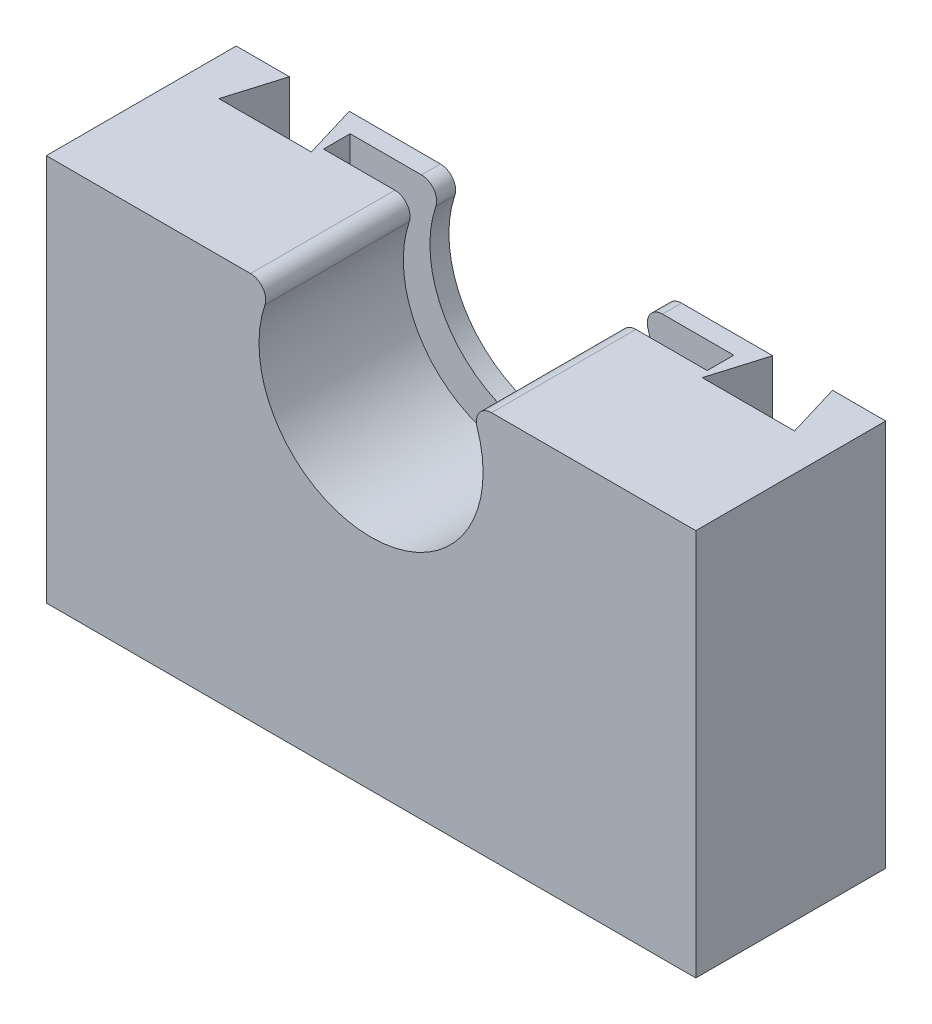
ISO-10303-21;
HEADER;
FILE_DESCRIPTION(('STEP AP214'),'2;1');
FILE_NAME('part.step','',(''),(''),'','','');
FILE_SCHEMA(('AUTOMOTIVE_DESIGN { 1 0 10303 214 1 1 1 1 }'));
ENDSEC;
DATA;
#1=APPLICATION_CONTEXT('core data for automotive mechanical design processes');
#2=APPLICATION_PROTOCOL_DEFINITION('international standard','automotive_design',2000,#1);
#3=PRODUCT_CONTEXT('',#1,'mechanical');
#4=PRODUCT('Part','Part','',(#3));
#5=PRODUCT_RELATED_PRODUCT_CATEGORY('part','',(#4));
#6=PRODUCT_DEFINITION_FORMATION('','',#4);
#7=PRODUCT_DEFINITION_CONTEXT('part definition',#1,'design');
#8=PRODUCT_DEFINITION('design','',#6,#7);
#9=PRODUCT_DEFINITION_SHAPE('','',#8);
#10=(LENGTH_UNIT() NAMED_UNIT(*) SI_UNIT(.MILLI.,.METRE.));
#11=(NAMED_UNIT(*) PLANE_ANGLE_UNIT() SI_UNIT($,.RADIAN.));
#12=(NAMED_UNIT(*) SI_UNIT($,.STERADIAN.) SOLID_ANGLE_UNIT());
#13=UNCERTAINTY_MEASURE_WITH_UNIT(LENGTH_MEASURE(1.E-05),#10,'distance_accuracy_value','');
#14=(GEOMETRIC_REPRESENTATION_CONTEXT(3) GLOBAL_UNCERTAINTY_ASSIGNED_CONTEXT((#13)) GLOBAL_UNIT_ASSIGNED_CONTEXT((#10,
#11,#12)) REPRESENTATION_CONTEXT('',''));
#15=CARTESIAN_POINT('',(0.,0.,0.));
#16=DIRECTION('',(0.,0.,1.));
#17=DIRECTION('',(1.,0.,0.));
#18=AXIS2_PLACEMENT_3D('',#15,#16,#17);
#19=CARTESIAN_POINT('',(27.0146670463276,26.0149253731343,25.));
#20=DIRECTION('',(0.,0.,-1.));
#21=DIRECTION('',(-1.,0.,0.));
#22=AXIS2_PLACEMENT_3D('',#19,#20,#21);
#23=CYLINDRICAL_SURFACE('',#22,2.);
#24=CARTESIAN_POINT('',(27.0146670463276,26.0149253731343,2.5));
#25=DIRECTION('',(0.,0.,1.));
#26=DIRECTION('',(1.,0.,0.));
#27=AXIS2_PLACEMENT_3D('',#24,#25,#26);
#28=CIRCLE('',#27,2.);
#29=CARTESIAN_POINT('',(27.0146670463276,28.0149253731343,2.5));
#30=VERTEX_POINT('',#29);
#31=CARTESIAN_POINT('',(25.1204378482512,25.3731343283582,2.5));
#32=VERTEX_POINT('',#31);
#33=EDGE_CURVE('E253',#30,#32,#28,.T.);
#34=ORIENTED_EDGE('',*,*,#33,.F.);
#35=DIRECTION('',(0.,0.,-1.));
#36=VECTOR('',#35,1.);
#37=CARTESIAN_POINT('',(27.0146670463276,28.0149253731343,25.));
#38=LINE('',#37,#36);
#39=CARTESIAN_POINT('',(27.0146670463276,28.0149253731343,0.));
#40=VERTEX_POINT('',#39);
#41=EDGE_CURVE('E432',#30,#40,#38,.T.);
#42=ORIENTED_EDGE('',*,*,#41,.T.);
#43=CARTESIAN_POINT('',(27.0146670463276,26.0149253731343,0.));
#44=DIRECTION('',(0.,0.,1.));
#45=DIRECTION('',(1.,0.,0.));
#46=AXIS2_PLACEMENT_3D('',#43,#44,#45);
#47=CIRCLE('',#46,2.);
#48=CARTESIAN_POINT('',(25.1204378482512,25.3731343283582,0.));
#49=VERTEX_POINT('',#48);
#50=EDGE_CURVE('E385',#40,#49,#47,.T.);
#51=ORIENTED_EDGE('',*,*,#50,.T.);
#52=DIRECTION('',(0.,0.,-1.));
#53=VECTOR('',#52,1.);
#54=CARTESIAN_POINT('',(25.1204378482512,25.3731343283582,25.));
#55=LINE('',#54,#53);
#56=EDGE_CURVE('E428',#32,#49,#55,.T.);
#57=ORIENTED_EDGE('',*,*,#56,.F.);
#58=EDGE_LOOP('',(#34,#42,#51,#57));
#59=FACE_BOUND('',#58,.T.);
#60=ADVANCED_FACE('F43',(#59),#23,.T.);
#61=CARTESIAN_POINT('',(11.1504975124378,20.6399253731341,25.));
#62=DIRECTION('',(0.,0.,-1.));
#63=DIRECTION('',(-1.,0.,0.));
#64=AXIS2_PLACEMENT_3D('',#61,#62,#63);
#65=CYLINDRICAL_SURFACE('',#64,14.75);
#66=CARTESIAN_POINT('',(11.1504975124378,20.6399253731341,2.5));
#67=DIRECTION('',(0.,0.,1.));
#68=DIRECTION('',(1.,0.,0.));
#69=AXIS2_PLACEMENT_3D('',#66,#67,#68);
#70=CIRCLE('',#69,14.75);
#71=CARTESIAN_POINT('',(-2.81944282337562,25.3731343283582,2.5));
#72=VERTEX_POINT('',#71);
#73=EDGE_CURVE('E249',#32,#72,#70,.F.);
#74=ORIENTED_EDGE('',*,*,#73,.F.);
#75=ORIENTED_EDGE('',*,*,#56,.T.);
#76=CARTESIAN_POINT('',(11.1504975124378,20.6399253731341,0.));
#77=DIRECTION('',(0.,0.,-1.));
#78=DIRECTION('',(1.,0.,0.));
#79=AXIS2_PLACEMENT_3D('',#76,#77,#78);
#80=CIRCLE('',#79,14.75);
#81=CARTESIAN_POINT('',(-2.81944282337562,25.3731343283582,0.));
#82=VERTEX_POINT('',#81);
#83=EDGE_CURVE('E389',#49,#82,#80,.T.);
#84=ORIENTED_EDGE('',*,*,#83,.T.);
#85=DIRECTION('',(0.,0.,-1.));
#86=VECTOR('',#85,1.);
#87=CARTESIAN_POINT('',(-2.81944282337562,25.3731343283582,25.));
#88=LINE('',#87,#86);
#89=EDGE_CURVE('E423',#72,#82,#88,.T.);
#90=ORIENTED_EDGE('',*,*,#89,.F.);
#91=EDGE_LOOP('',(#74,#75,#84,#90));
#92=FACE_BOUND('',#91,.T.);
#93=ADVANCED_FACE('F456',(#92),#65,.F.);
#94=CARTESIAN_POINT('',(-4.71367202145201,26.0149253731343,25.));
#95=DIRECTION('',(0.,0.,-1.));
#96=DIRECTION('',(-1.,0.,0.));
#97=AXIS2_PLACEMENT_3D('',#94,#95,#96);
#98=CYLINDRICAL_SURFACE('',#97,2.);
#99=CARTESIAN_POINT('',(-4.71367202145201,26.0149253731343,2.5));
#100=DIRECTION('',(0.,0.,1.));
#101=DIRECTION('',(1.,0.,0.));
#102=AXIS2_PLACEMENT_3D('',#99,#100,#101);
#103=CIRCLE('',#102,2.);
#104=CARTESIAN_POINT('',(-4.71367202145201,28.0149253731343,2.5));
#105=VERTEX_POINT('',#104);
#106=EDGE_CURVE('E59',#72,#105,#103,.T.);
#107=ORIENTED_EDGE('',*,*,#106,.F.);
#108=ORIENTED_EDGE('',*,*,#89,.T.);
#109=CARTESIAN_POINT('',(-4.71367202145201,26.0149253731343,0.));
#110=DIRECTION('',(0.,0.,1.));
#111=DIRECTION('',(-1.,0.,0.));
#112=AXIS2_PLACEMENT_3D('',#109,#110,#111);
#113=CIRCLE('',#112,2.);
#114=CARTESIAN_POINT('',(-4.71367202145201,28.0149253731343,0.));
#115=VERTEX_POINT('',#114);
#116=EDGE_CURVE('E393',#82,#115,#113,.T.);
#117=ORIENTED_EDGE('',*,*,#116,.T.);
#118=DIRECTION('',(0.,0.,-1.));
#119=VECTOR('',#118,1.);
#120=CARTESIAN_POINT('',(-4.71367202145201,28.0149253731343,25.));
#121=LINE('',#120,#119);
#122=EDGE_CURVE('E418',#105,#115,#121,.T.);
#123=ORIENTED_EDGE('',*,*,#122,.F.);
#124=EDGE_LOOP('',(#107,#108,#117,#123));
#125=FACE_BOUND('',#124,.T.);
#126=ADVANCED_FACE('F513',(#125),#98,.T.);
#127=CARTESIAN_POINT('',(53.9004975124378,28.0149253731343,25.));
#128=DIRECTION('',(-1.,0.,0.));
#129=DIRECTION('',(0.,0.,1.));
#130=AXIS2_PLACEMENT_3D('',#127,#128,#129);
#131=PLANE('',#130);
#132=DIRECTION('',(0.,1.,0.));
#133=VECTOR('',#132,1.);
#134=CARTESIAN_POINT('',(53.9004975124378,28.0149253731343,0.));
#135=LINE('',#134,#133);
#136=CARTESIAN_POINT('',(53.9004975124378,-22.9850746268657,0.));
#137=VERTEX_POINT('',#136);
#138=CARTESIAN_POINT('',(53.9004975124378,28.0149253731343,0.));
#139=VERTEX_POINT('',#138);
#140=EDGE_CURVE('E346',#137,#139,#135,.T.);
#141=ORIENTED_EDGE('',*,*,#140,.T.);
#142=DIRECTION('',(0.,0.,-1.));
#143=VECTOR('',#142,1.);
#144=CARTESIAN_POINT('',(53.9004975124378,28.0149253731343,25.));
#145=LINE('',#144,#143);
#146=CARTESIAN_POINT('',(53.9004975124378,28.0149253731343,25.));
#147=VERTEX_POINT('',#146);
#148=EDGE_CURVE('E11',#147,#139,#145,.T.);
#149=ORIENTED_EDGE('',*,*,#148,.F.);
#150=DIRECTION('',(0.,1.,0.));
#151=VECTOR('',#150,1.);
#152=CARTESIAN_POINT('',(53.9004975124378,28.0149253731343,25.));
#153=LINE('',#152,#151);
#154=CARTESIAN_POINT('',(53.9004975124378,-22.9850746268657,25.));
#155=VERTEX_POINT('',#154);
#156=EDGE_CURVE('E350',#155,#147,#153,.T.);
#157=ORIENTED_EDGE('',*,*,#156,.F.);
#158=DIRECTION('',(0.,0.,-1.));
#159=VECTOR('',#158,1.);
#160=CARTESIAN_POINT('',(53.9004975124378,-22.9850746268657,25.));
#161=LINE('',#160,#159);
#162=EDGE_CURVE('E376',#155,#137,#161,.T.);
#163=ORIENTED_EDGE('',*,*,#162,.T.);
#164=EDGE_LOOP('',(#141,#149,#157,#163));
#165=FACE_BOUND('',#164,.T.);
#166=ADVANCED_FACE('F45',(#165),#131,.F.);
#167=CARTESIAN_POINT('',(53.9004975124378,28.0149253731343,25.));
#168=DIRECTION('',(0.,-1.,0.));
#169=DIRECTION('',(1.,0.,0.));
#170=AXIS2_PLACEMENT_3D('',#167,#168,#169);
#171=PLANE('',#170);
#172=DIRECTION('',(0.,0.,-1.));
#173=VECTOR('',#172,1.);
#174=CARTESIAN_POINT('',(36.4004975124378,28.0149253731343,6.));
#175=LINE('',#174,#173);
#176=CARTESIAN_POINT('',(36.4004975124378,28.0149253731343,6.));
#177=VERTEX_POINT('',#176);
#178=CARTESIAN_POINT('',(36.4004975124378,28.0149253731343,2.5));
#179=VERTEX_POINT('',#178);
#180=EDGE_CURVE('E225',#177,#179,#175,.T.);
#181=ORIENTED_EDGE('',*,*,#180,.F.);
#182=DIRECTION('',(1.,0.,0.));
#183=VECTOR('',#182,1.);
#184=CARTESIAN_POINT('',(36.4004975124378,28.0149253731343,6.));
#185=LINE('',#184,#183);
#186=CARTESIAN_POINT('',(27.0146670463276,28.0149253731343,6.));
#187=VERTEX_POINT('',#186);
#188=EDGE_CURVE('E207',#187,#177,#185,.T.);
#189=ORIENTED_EDGE('',*,*,#188,.F.);
#190=CARTESIAN_POINT('',(27.0146670463276,28.0149253731343,25.));
#191=VERTEX_POINT('',#190);
#192=EDGE_CURVE('E52',#191,#187,#38,.T.);
#193=ORIENTED_EDGE('',*,*,#192,.F.);
#194=DIRECTION('',(-1.,0.,0.));
#195=VECTOR('',#194,1.);
#196=CARTESIAN_POINT('',(53.9004975124378,28.0149253731343,25.));
#197=LINE('',#196,#195);
#198=EDGE_CURVE('E354',#147,#191,#197,.T.);
#199=ORIENTED_EDGE('',*,*,#198,.F.);
#200=ORIENTED_EDGE('',*,*,#148,.T.);
#201=DIRECTION('',(-1.,0.,0.));
#202=VECTOR('',#201,1.);
#203=CARTESIAN_POINT('',(53.9004975124378,28.0149253731343,0.));
#204=LINE('',#203,#202);
#205=CARTESIAN_POINT('',(46.9004975124378,28.0149253731343,0.));
#206=VERTEX_POINT('',#205);
#207=EDGE_CURVE('E381',#139,#206,#204,.T.);
#208=ORIENTED_EDGE('',*,*,#207,.T.);
#209=DIRECTION('',(-0.287193343911967,0.,-0.957872634128704));
#210=VECTOR('',#209,1.);
#211=CARTESIAN_POINT('',(46.9004975124378,28.0149253731343,0.));
#212=LINE('',#211,#210);
#213=CARTESIAN_POINT('',(49.040087924582,28.0149253731343,7.13615112425884));
#214=VERTEX_POINT('',#213);
#215=EDGE_CURVE('E318',#214,#206,#212,.T.);
#216=ORIENTED_EDGE('',*,*,#215,.F.);
#217=DIRECTION('',(1.,0.,0.));
#218=VECTOR('',#217,1.);
#219=CARTESIAN_POINT('',(49.040087924582,28.0149253731343,7.13615112425884));
#220=LINE('',#219,#218);
#221=CARTESIAN_POINT('',(36.8750766341835,28.0149253731343,7.13615112425885));
#222=VERTEX_POINT('',#221);
#223=EDGE_CURVE('E321',#222,#214,#220,.T.);
#224=ORIENTED_EDGE('',*,*,#223,.F.);
#225=DIRECTION('',(-0.287193343911964,0.,0.957872634128705));
#226=VECTOR('',#225,1.);
#227=CARTESIAN_POINT('',(36.8750766341835,28.0149253731343,7.13615112425885));
#228=LINE('',#227,#226);
#229=CARTESIAN_POINT('',(39.0146670463276,28.0149253731343,0.));
#230=VERTEX_POINT('',#229);
#231=EDGE_CURVE('E286',#230,#222,#228,.T.);
#232=ORIENTED_EDGE('',*,*,#231,.F.);
#233=EDGE_CURVE('E380',#230,#40,#204,.T.);
#234=ORIENTED_EDGE('',*,*,#233,.T.);
#235=ORIENTED_EDGE('',*,*,#41,.F.);
#236=DIRECTION('',(1.,0.,0.));
#237=VECTOR('',#236,1.);
#238=CARTESIAN_POINT('',(36.4004975124378,28.0149253731343,2.5));
#239=LINE('',#238,#237);
#240=EDGE_CURVE('E235',#30,#179,#239,.T.);
#241=ORIENTED_EDGE('',*,*,#240,.T.);
#242=EDGE_LOOP('',(#181,#189,#193,#199,#200,#208,#216,#224,#232,#234,#235,#241));
#243=FACE_BOUND('',#242,.T.);
#244=ADVANCED_FACE('F233',(#243),#171,.F.);
#245=ORIENTED_EDGE('',*,*,#192,.T.);
#246=CARTESIAN_POINT('',(27.0146670463276,26.0149253731343,6.));
#247=DIRECTION('',(0.,0.,1.));
#248=DIRECTION('',(1.,0.,0.));
#249=AXIS2_PLACEMENT_3D('',#246,#247,#248);
#250=CIRCLE('',#249,2.);
#251=CARTESIAN_POINT('',(25.1204378482512,25.3731343283582,6.));
#252=VERTEX_POINT('',#251);
#253=EDGE_CURVE('E213',#187,#252,#250,.T.);
#254=ORIENTED_EDGE('',*,*,#253,.T.);
#255=CARTESIAN_POINT('',(25.1204378482512,25.3731343283582,25.));
#256=VERTEX_POINT('',#255);
#257=EDGE_CURVE('E429',#256,#252,#55,.T.);
#258=ORIENTED_EDGE('',*,*,#257,.F.);
#259=CARTESIAN_POINT('',(27.0146670463276,26.0149253731343,25.));
#260=DIRECTION('',(0.,0.,1.));
#261=DIRECTION('',(1.,0.,0.));
#262=AXIS2_PLACEMENT_3D('',#259,#260,#261);
#263=CIRCLE('',#262,2.);
#264=EDGE_CURVE('E358',#191,#256,#263,.T.);
#265=ORIENTED_EDGE('',*,*,#264,.F.);
#266=EDGE_LOOP('',(#245,#254,#258,#265));
#267=FACE_BOUND('',#266,.T.);
#268=ADVANCED_FACE('F501',(#267),#23,.T.);
#269=ORIENTED_EDGE('',*,*,#257,.T.);
#270=CARTESIAN_POINT('',(11.1504975124378,20.6399253731341,6.));
#271=DIRECTION('',(0.,0.,1.));
#272=DIRECTION('',(1.,0.,0.));
#273=AXIS2_PLACEMENT_3D('',#270,#271,#272);
#274=CIRCLE('',#273,14.75);
#275=CARTESIAN_POINT('',(-2.81944282337562,25.3731343283582,6.));
#276=VERTEX_POINT('',#275);
#277=EDGE_CURVE('E260',#252,#276,#274,.F.);
#278=ORIENTED_EDGE('',*,*,#277,.T.);
#279=CARTESIAN_POINT('',(-2.81944282337562,25.3731343283582,25.));
#280=VERTEX_POINT('',#279);
#281=EDGE_CURVE('E424',#280,#276,#88,.T.);
#282=ORIENTED_EDGE('',*,*,#281,.F.);
#283=CARTESIAN_POINT('',(11.1504975124378,20.6399253731341,25.));
#284=DIRECTION('',(0.,0.,-1.));
#285=DIRECTION('',(1.,0.,0.));
#286=AXIS2_PLACEMENT_3D('',#283,#284,#285);
#287=CIRCLE('',#286,14.75);
#288=EDGE_CURVE('E361',#256,#280,#287,.T.);
#289=ORIENTED_EDGE('',*,*,#288,.F.);
#290=EDGE_LOOP('',(#269,#278,#282,#289));
#291=FACE_BOUND('',#290,.T.);
#292=ADVANCED_FACE('F500',(#291),#65,.F.);
#293=ORIENTED_EDGE('',*,*,#281,.T.);
#294=CARTESIAN_POINT('',(-4.71367202145201,26.0149253731343,6.));
#295=DIRECTION('',(0.,0.,1.));
#296=DIRECTION('',(1.,0.,0.));
#297=AXIS2_PLACEMENT_3D('',#294,#295,#296);
#298=CIRCLE('',#297,2.);
#299=CARTESIAN_POINT('',(-4.71367202145202,28.0149253731343,6.));
#300=VERTEX_POINT('',#299);
#301=EDGE_CURVE('E256',#276,#300,#298,.T.);
#302=ORIENTED_EDGE('',*,*,#301,.T.);
#303=CARTESIAN_POINT('',(-4.71367202145201,28.0149253731343,25.));
#304=VERTEX_POINT('',#303);
#305=EDGE_CURVE('E419',#304,#300,#121,.T.);
#306=ORIENTED_EDGE('',*,*,#305,.F.);
#307=CARTESIAN_POINT('',(-4.71367202145201,26.0149253731343,25.));
#308=DIRECTION('',(0.,0.,1.));
#309=DIRECTION('',(-1.,0.,0.));
#310=AXIS2_PLACEMENT_3D('',#307,#308,#309);
#311=CIRCLE('',#310,2.);
#312=EDGE_CURVE('E364',#280,#304,#311,.T.);
#313=ORIENTED_EDGE('',*,*,#312,.F.);
#314=EDGE_LOOP('',(#293,#302,#306,#313));
#315=FACE_BOUND('',#314,.T.);
#316=ADVANCED_FACE('F487',(#315),#98,.T.);
#317=CARTESIAN_POINT('',(-4.71367202145201,28.0149253731343,25.));
#318=DIRECTION('',(0.,-1.,0.));
#319=DIRECTION('',(1.,0.,0.));
#320=AXIS2_PLACEMENT_3D('',#317,#318,#319);
#321=PLANE('',#320);
#322=ORIENTED_EDGE('',*,*,#305,.T.);
#323=CARTESIAN_POINT('',(-14.0995024875622,28.0149253731343,6.));
#324=VERTEX_POINT('',#323);
#325=EDGE_CURVE('E219',#324,#300,#185,.T.);
#326=ORIENTED_EDGE('',*,*,#325,.F.);
#327=DIRECTION('',(0.,0.,-1.));
#328=VECTOR('',#327,1.);
#329=CARTESIAN_POINT('',(-14.0995024875622,28.0149253731343,6.));
#330=LINE('',#329,#328);
#331=CARTESIAN_POINT('',(-14.0995024875622,28.0149253731343,2.5));
#332=VERTEX_POINT('',#331);
#333=EDGE_CURVE('E250',#324,#332,#330,.T.);
#334=ORIENTED_EDGE('',*,*,#333,.T.);
#335=EDGE_CURVE('E478',#332,#105,#239,.T.);
#336=ORIENTED_EDGE('',*,*,#335,.T.);
#337=ORIENTED_EDGE('',*,*,#122,.T.);
#338=DIRECTION('',(-1.,0.,0.));
#339=VECTOR('',#338,1.);
#340=CARTESIAN_POINT('',(-4.71367202145201,28.0149253731343,0.));
#341=LINE('',#340,#339);
#342=CARTESIAN_POINT('',(-16.713672021452,28.0149253731343,0.));
#343=VERTEX_POINT('',#342);
#344=EDGE_CURVE('E398',#115,#343,#341,.T.);
#345=ORIENTED_EDGE('',*,*,#344,.T.);
#346=DIRECTION('',(-0.287115798996212,0.,-0.95789588054588));
#347=VECTOR('',#346,1.);
#348=CARTESIAN_POINT('',(-14.5746593189302,28.0149253731343,7.13632431006681));
#349=LINE('',#348,#347);
#350=CARTESIAN_POINT('',(-14.5746593189302,28.0149253731343,7.13632431006681));
#351=VERTEX_POINT('',#350);
#352=EDGE_CURVE('E271',#351,#343,#349,.T.);
#353=ORIENTED_EDGE('',*,*,#352,.F.);
#354=DIRECTION('',(1.,0.,0.));
#355=VECTOR('',#354,1.);
#356=CARTESIAN_POINT('',(-26.738515190084,28.0149253731343,7.13632431006681));
#357=LINE('',#356,#355);
#358=CARTESIAN_POINT('',(-26.738515190084,28.0149253731343,7.13632431006681));
#359=VERTEX_POINT('',#358);
#360=EDGE_CURVE('E285',#359,#351,#357,.T.);
#361=ORIENTED_EDGE('',*,*,#360,.F.);
#362=DIRECTION('',(-0.287115798996211,0.,0.95789588054588));
#363=VECTOR('',#362,1.);
#364=CARTESIAN_POINT('',(-24.5995024875622,28.0149253731343,0.));
#365=LINE('',#364,#363);
#366=CARTESIAN_POINT('',(-24.5995024875622,28.0149253731343,0.));
#367=VERTEX_POINT('',#366);
#368=EDGE_CURVE('E281',#367,#359,#365,.T.);
#369=ORIENTED_EDGE('',*,*,#368,.F.);
#370=CARTESIAN_POINT('',(-31.5995024875622,28.0149253731343,0.));
#371=VERTEX_POINT('',#370);
#372=EDGE_CURVE('E397',#367,#371,#341,.T.);
#373=ORIENTED_EDGE('',*,*,#372,.T.);
#374=DIRECTION('',(0.,0.,-1.));
#375=VECTOR('',#374,1.);
#376=CARTESIAN_POINT('',(-31.5995024875622,28.0149253731343,25.));
#377=LINE('',#376,#375);
#378=CARTESIAN_POINT('',(-31.5995024875622,28.0149253731343,25.));
#379=VERTEX_POINT('',#378);
#380=EDGE_CURVE('E414',#379,#371,#377,.T.);
#381=ORIENTED_EDGE('',*,*,#380,.F.);
#382=DIRECTION('',(-1.,0.,0.));
#383=VECTOR('',#382,1.);
#384=CARTESIAN_POINT('',(-4.71367202145201,28.0149253731343,25.));
#385=LINE('',#384,#383);
#386=EDGE_CURVE('E367',#304,#379,#385,.T.);
#387=ORIENTED_EDGE('',*,*,#386,.F.);
#388=EDGE_LOOP('',(#322,#326,#334,#336,#337,#345,#353,#361,#369,#373,#381,#387));
#389=FACE_BOUND('',#388,.T.);
#390=ADVANCED_FACE('F491',(#389),#321,.F.);
#391=CARTESIAN_POINT('',(-31.5995024875622,28.0149253731343,25.));
#392=DIRECTION('',(1.,0.,0.));
#393=DIRECTION('',(0.,0.,-1.));
#394=AXIS2_PLACEMENT_3D('',#391,#392,#393);
#395=PLANE('',#394);
#396=DIRECTION('',(0.,-1.,0.));
#397=VECTOR('',#396,1.);
#398=CARTESIAN_POINT('',(-31.5995024875622,28.0149253731343,0.));
#399=LINE('',#398,#397);
#400=CARTESIAN_POINT('',(-31.5995024875622,-22.9850746268657,0.));
#401=VERTEX_POINT('',#400);
#402=EDGE_CURVE('E402',#371,#401,#399,.T.);
#403=ORIENTED_EDGE('',*,*,#402,.T.);
#404=DIRECTION('',(0.,0.,-1.));
#405=VECTOR('',#404,1.);
#406=CARTESIAN_POINT('',(-31.5995024875622,-22.9850746268657,25.));
#407=LINE('',#406,#405);
#408=CARTESIAN_POINT('',(-31.5995024875622,-22.9850746268657,25.));
#409=VERTEX_POINT('',#408);
#410=EDGE_CURVE('E410',#409,#401,#407,.T.);
#411=ORIENTED_EDGE('',*,*,#410,.F.);
#412=DIRECTION('',(0.,-1.,0.));
#413=VECTOR('',#412,1.);
#414=CARTESIAN_POINT('',(-31.5995024875622,28.0149253731343,25.));
#415=LINE('',#414,#413);
#416=EDGE_CURVE('E370',#379,#409,#415,.T.);
#417=ORIENTED_EDGE('',*,*,#416,.F.);
#418=ORIENTED_EDGE('',*,*,#380,.T.);
#419=EDGE_LOOP('',(#403,#411,#417,#418));
#420=FACE_BOUND('',#419,.T.);
#421=ADVANCED_FACE('F523',(#420),#395,.F.);
#422=CARTESIAN_POINT('',(53.9004975124378,-22.9850746268657,25.));
#423=DIRECTION('',(0.,1.,0.));
#424=DIRECTION('',(0.,0.,1.));
#425=AXIS2_PLACEMENT_3D('',#422,#423,#424);
#426=PLANE('',#425);
#427=DIRECTION('',(1.,0.,0.));
#428=VECTOR('',#427,1.);
#429=CARTESIAN_POINT('',(53.9004975124378,-22.9850746268657,0.));
#430=LINE('',#429,#428);
#431=EDGE_CURVE('E355',#401,#137,#430,.T.);
#432=ORIENTED_EDGE('',*,*,#431,.T.);
#433=ORIENTED_EDGE('',*,*,#162,.F.);
#434=DIRECTION('',(1.,0.,0.));
#435=VECTOR('',#434,1.);
#436=CARTESIAN_POINT('',(53.9004975124378,-22.9850746268657,25.));
#437=LINE('',#436,#435);
#438=EDGE_CURVE('E373',#409,#155,#437,.T.);
#439=ORIENTED_EDGE('',*,*,#438,.F.);
#440=ORIENTED_EDGE('',*,*,#410,.T.);
#441=EDGE_LOOP('',(#432,#433,#439,#440));
#442=FACE_BOUND('',#441,.T.);
#443=ADVANCED_FACE('F526',(#442),#426,.F.);
#444=CARTESIAN_POINT('',(-4.71367202145201,26.0149253731343,25.));
#445=DIRECTION('',(0.,0.,-1.));
#446=DIRECTION('',(-1.,0.,0.));
#447=AXIS2_PLACEMENT_3D('',#444,#445,#446);
#448=PLANE('',#447);
#449=ORIENTED_EDGE('',*,*,#156,.T.);
#450=ORIENTED_EDGE('',*,*,#198,.T.);
#451=ORIENTED_EDGE('',*,*,#264,.T.);
#452=ORIENTED_EDGE('',*,*,#288,.T.);
#453=ORIENTED_EDGE('',*,*,#312,.T.);
#454=ORIENTED_EDGE('',*,*,#386,.T.);
#455=ORIENTED_EDGE('',*,*,#416,.T.);
#456=ORIENTED_EDGE('',*,*,#438,.T.);
#457=EDGE_LOOP('',(#449,#450,#451,#452,#453,#454,#455,#456));
#458=FACE_BOUND('',#457,.T.);
#459=ADVANCED_FACE('F495',(#458),#448,.F.);
#460=CARTESIAN_POINT('',(-4.71367202145201,26.0149253731343,0.));
#461=DIRECTION('',(0.,0.,-1.));
#462=DIRECTION('',(-1.,0.,0.));
#463=AXIS2_PLACEMENT_3D('',#460,#461,#462);
#464=PLANE('',#463);
#465=DIRECTION('',(0.,1.,0.));
#466=VECTOR('',#465,1.);
#467=CARTESIAN_POINT('',(-16.713672021452,3.01492537313433,0.));
#468=LINE('',#467,#466);
#469=CARTESIAN_POINT('',(-16.713672021452,3.01492537313433,0.));
#470=VERTEX_POINT('',#469);
#471=EDGE_CURVE('E292',#470,#343,#468,.T.);
#472=ORIENTED_EDGE('',*,*,#471,.T.);
#473=ORIENTED_EDGE('',*,*,#344,.F.);
#474=ORIENTED_EDGE('',*,*,#116,.F.);
#475=ORIENTED_EDGE('',*,*,#83,.F.);
#476=ORIENTED_EDGE('',*,*,#50,.F.);
#477=ORIENTED_EDGE('',*,*,#233,.F.);
#478=DIRECTION('',(0.,1.,0.));
#479=VECTOR('',#478,1.);
#480=CARTESIAN_POINT('',(39.0146670463276,3.01492537313434,0.));
#481=LINE('',#480,#479);
#482=CARTESIAN_POINT('',(39.0146670463276,3.01492537313434,0.));
#483=VERTEX_POINT('',#482);
#484=EDGE_CURVE('E305',#483,#230,#481,.T.);
#485=ORIENTED_EDGE('',*,*,#484,.F.);
#486=DIRECTION('',(-1.,0.,0.));
#487=VECTOR('',#486,1.);
#488=CARTESIAN_POINT('',(39.0146670463276,3.01492537313434,0.));
#489=LINE('',#488,#487);
#490=CARTESIAN_POINT('',(46.9004975124378,3.01492537313433,0.));
#491=VERTEX_POINT('',#490);
#492=EDGE_CURVE('E322',#491,#483,#489,.T.);
#493=ORIENTED_EDGE('',*,*,#492,.F.);
#494=DIRECTION('',(0.,1.,0.));
#495=VECTOR('',#494,1.);
#496=CARTESIAN_POINT('',(46.9004975124378,3.01492537313434,0.));
#497=LINE('',#496,#495);
#498=EDGE_CURVE('E266',#491,#206,#497,.T.);
#499=ORIENTED_EDGE('',*,*,#498,.T.);
#500=ORIENTED_EDGE('',*,*,#207,.F.);
#501=ORIENTED_EDGE('',*,*,#140,.F.);
#502=ORIENTED_EDGE('',*,*,#431,.F.);
#503=ORIENTED_EDGE('',*,*,#402,.F.);
#504=ORIENTED_EDGE('',*,*,#372,.F.);
#505=DIRECTION('',(0.,1.,0.));
#506=VECTOR('',#505,1.);
#507=CARTESIAN_POINT('',(-24.5995024875622,3.01492537313433,0.));
#508=LINE('',#507,#506);
#509=CARTESIAN_POINT('',(-24.5995024875622,3.01492537313433,0.));
#510=VERTEX_POINT('',#509);
#511=EDGE_CURVE('E280',#510,#367,#508,.T.);
#512=ORIENTED_EDGE('',*,*,#511,.F.);
#513=DIRECTION('',(-1.,0.,0.));
#514=VECTOR('',#513,1.);
#515=CARTESIAN_POINT('',(-24.5995024875622,3.01492537313433,0.));
#516=LINE('',#515,#514);
#517=EDGE_CURVE('E267',#470,#510,#516,.T.);
#518=ORIENTED_EDGE('',*,*,#517,.F.);
#519=EDGE_LOOP('',(#472,#473,#474,#475,#476,#477,#485,#493,#499,#500,#501,#502,#503,#504,#512,#518));
#520=FACE_BOUND('',#519,.T.);
#521=CARTESIAN_POINT('',(11.1504975124378,-2.91007462686588,0.));
#522=DIRECTION('',(0.,0.,-1.));
#523=DIRECTION('',(-1.,0.,0.));
#524=AXIS2_PLACEMENT_3D('',#521,#522,#523);
#525=CIRCLE('',#524,4.4);
#526=CARTESIAN_POINT('',(6.75049751243781,-2.91007462686588,0.));
#527=VERTEX_POINT('',#526);
#528=EDGE_CURVE('E296',#527,#527,#525,.T.);
#529=ORIENTED_EDGE('',*,*,#528,.F.);
#530=EDGE_LOOP('',(#529));
#531=FACE_BOUND('',#530,.T.);
#532=ADVANCED_FACE('F449',(#520,#531),#464,.T.);
#533=CARTESIAN_POINT('',(11.1504975124378,-2.91007462686588,4.8));
#534=DIRECTION('',(0.,0.,-1.));
#535=DIRECTION('',(-1.,0.,0.));
#536=AXIS2_PLACEMENT_3D('',#533,#534,#535);
#537=CYLINDRICAL_SURFACE('',#536,4.4);
#538=CARTESIAN_POINT('',(11.1504975124378,-2.91007462686588,4.8));
#539=DIRECTION('',(0.,0.,-1.));
#540=DIRECTION('',(-1.,0.,0.));
#541=AXIS2_PLACEMENT_3D('',#538,#539,#540);
#542=CIRCLE('',#541,4.4);
#543=CARTESIAN_POINT('',(6.75049751243781,-2.91007462686588,4.8));
#544=VERTEX_POINT('',#543);
#545=EDGE_CURVE('E342',#544,#544,#542,.T.);
#546=ORIENTED_EDGE('',*,*,#545,.F.);
#547=EDGE_LOOP('',(#546));
#548=FACE_BOUND('',#547,.T.);
#549=ORIENTED_EDGE('',*,*,#528,.T.);
#550=EDGE_LOOP('',(#549));
#551=FACE_BOUND('',#550,.T.);
#552=ADVANCED_FACE('F533',(#548,#551),#537,.F.);
#553=CARTESIAN_POINT('',(11.1504975124378,-2.91007462686588,4.8));
#554=DIRECTION('',(0.,0.,-1.));
#555=DIRECTION('',(-1.,0.,0.));
#556=AXIS2_PLACEMENT_3D('',#553,#554,#555);
#557=PLANE('',#556);
#558=ORIENTED_EDGE('',*,*,#545,.T.);
#559=EDGE_LOOP('',(#558));
#560=FACE_BOUND('',#559,.T.);
#561=ADVANCED_FACE('F538',(#560),#557,.T.);
#562=CARTESIAN_POINT('',(46.9004975124378,3.01492537313434,0.));
#563=DIRECTION('',(0.957872634128704,0.,-0.287193343911967));
#564=DIRECTION('',(-0.287193343911967,0.,-0.957872634128705));
#565=AXIS2_PLACEMENT_3D('',#562,#563,#564);
#566=PLANE('',#565);
#567=ORIENTED_EDGE('',*,*,#215,.T.);
#568=ORIENTED_EDGE('',*,*,#498,.F.);
#569=DIRECTION('',(-0.287193343911967,0.,-0.957872634128704));
#570=VECTOR('',#569,1.);
#571=CARTESIAN_POINT('',(46.9004975124378,3.01492537313434,0.));
#572=LINE('',#571,#570);
#573=CARTESIAN_POINT('',(49.040087924582,3.01492537313434,7.13615112425884));
#574=VERTEX_POINT('',#573);
#575=EDGE_CURVE('E308',#574,#491,#572,.T.);
#576=ORIENTED_EDGE('',*,*,#575,.F.);
#577=DIRECTION('',(0.,1.,0.));
#578=VECTOR('',#577,1.);
#579=CARTESIAN_POINT('',(49.040087924582,3.01492537313434,7.13615112425884));
#580=LINE('',#579,#578);
#581=EDGE_CURVE('E312',#574,#214,#580,.T.);
#582=ORIENTED_EDGE('',*,*,#581,.T.);
#583=EDGE_LOOP('',(#567,#568,#576,#582));
#584=FACE_BOUND('',#583,.T.);
#585=ADVANCED_FACE('F542',(#584),#566,.F.);
#586=CARTESIAN_POINT('',(49.040087924582,3.01492537313434,7.13615112425884));
#587=DIRECTION('',(0.,0.,1.));
#588=DIRECTION('',(1.,0.,0.));
#589=AXIS2_PLACEMENT_3D('',#586,#587,#588);
#590=PLANE('',#589);
#591=ORIENTED_EDGE('',*,*,#223,.T.);
#592=ORIENTED_EDGE('',*,*,#581,.F.);
#593=DIRECTION('',(1.,0.,0.));
#594=VECTOR('',#593,1.);
#595=CARTESIAN_POINT('',(49.040087924582,3.01492537313434,7.13615112425884));
#596=LINE('',#595,#594);
#597=CARTESIAN_POINT('',(36.8750766341835,3.01492537313433,7.13615112425885));
#598=VERTEX_POINT('',#597);
#599=EDGE_CURVE('E331',#598,#574,#596,.T.);
#600=ORIENTED_EDGE('',*,*,#599,.F.);
#601=DIRECTION('',(0.,1.,0.));
#602=VECTOR('',#601,1.);
#603=CARTESIAN_POINT('',(36.8750766341835,3.01492537313433,7.13615112425885));
#604=LINE('',#603,#602);
#605=EDGE_CURVE('E309',#598,#222,#604,.T.);
#606=ORIENTED_EDGE('',*,*,#605,.T.);
#607=EDGE_LOOP('',(#591,#592,#600,#606));
#608=FACE_BOUND('',#607,.T.);
#609=ADVANCED_FACE('F552',(#608),#590,.F.);
#610=CARTESIAN_POINT('',(36.8750766341835,3.01492537313433,7.13615112425885));
#611=DIRECTION('',(-0.957872634128705,0.,-0.287193343911964));
#612=DIRECTION('',(-0.287193343911965,0.,0.957872634128705));
#613=AXIS2_PLACEMENT_3D('',#610,#611,#612);
#614=PLANE('',#613);
#615=ORIENTED_EDGE('',*,*,#231,.T.);
#616=ORIENTED_EDGE('',*,*,#605,.F.);
#617=DIRECTION('',(-0.287193343911964,0.,0.957872634128705));
#618=VECTOR('',#617,1.);
#619=CARTESIAN_POINT('',(36.8750766341835,3.01492537313433,7.13615112425885));
#620=LINE('',#619,#618);
#621=EDGE_CURVE('E335',#483,#598,#620,.T.);
#622=ORIENTED_EDGE('',*,*,#621,.F.);
#623=ORIENTED_EDGE('',*,*,#484,.T.);
#624=EDGE_LOOP('',(#615,#616,#622,#623));
#625=FACE_BOUND('',#624,.T.);
#626=ADVANCED_FACE('F548',(#625),#614,.F.);
#627=CARTESIAN_POINT('',(0.,3.01492537313433,0.));
#628=DIRECTION('',(0.,-1.,0.));
#629=DIRECTION('',(0.,0.,-1.));
#630=AXIS2_PLACEMENT_3D('',#627,#628,#629);
#631=PLANE('',#630);
#632=ORIENTED_EDGE('',*,*,#492,.T.);
#633=ORIENTED_EDGE('',*,*,#621,.T.);
#634=ORIENTED_EDGE('',*,*,#599,.T.);
#635=ORIENTED_EDGE('',*,*,#575,.T.);
#636=EDGE_LOOP('',(#632,#633,#634,#635));
#637=FACE_BOUND('',#636,.T.);
#638=ADVANCED_FACE('F544',(#637),#631,.F.);
#639=CARTESIAN_POINT('',(-14.5746593189302,3.01492537313433,7.13632431006681));
#640=DIRECTION('',(0.95789588054588,0.,-0.287115798996212));
#641=DIRECTION('',(-0.287115798996212,0.,-0.95789588054588));
#642=AXIS2_PLACEMENT_3D('',#639,#640,#641);
#643=PLANE('',#642);
#644=ORIENTED_EDGE('',*,*,#352,.T.);
#645=ORIENTED_EDGE('',*,*,#471,.F.);
#646=DIRECTION('',(-0.287115798996212,0.,-0.95789588054588));
#647=VECTOR('',#646,1.);
#648=CARTESIAN_POINT('',(-14.5746593189302,3.01492537313433,7.13632431006681));
#649=LINE('',#648,#647);
#650=CARTESIAN_POINT('',(-14.5746593189302,3.01492537313433,7.13632431006681));
#651=VERTEX_POINT('',#650);
#652=EDGE_CURVE('E67',#651,#470,#649,.T.);
#653=ORIENTED_EDGE('',*,*,#652,.F.);
#654=DIRECTION('',(0.,1.,0.));
#655=VECTOR('',#654,1.);
#656=CARTESIAN_POINT('',(-14.5746593189302,3.01492537313433,7.13632431006681));
#657=LINE('',#656,#655);
#658=EDGE_CURVE('E297',#651,#351,#657,.T.);
#659=ORIENTED_EDGE('',*,*,#658,.T.);
#660=EDGE_LOOP('',(#644,#645,#653,#659));
#661=FACE_BOUND('',#660,.T.);
#662=ADVANCED_FACE('F547',(#661),#643,.F.);
#663=CARTESIAN_POINT('',(-26.738515190084,3.01492537313433,7.13632431006681));
#664=DIRECTION('',(0.,0.,1.));
#665=DIRECTION('',(1.,0.,0.));
#666=AXIS2_PLACEMENT_3D('',#663,#664,#665);
#667=PLANE('',#666);
#668=ORIENTED_EDGE('',*,*,#360,.T.);
#669=ORIENTED_EDGE('',*,*,#658,.F.);
#670=DIRECTION('',(1.,0.,0.));
#671=VECTOR('',#670,1.);
#672=CARTESIAN_POINT('',(-26.738515190084,3.01492537313433,7.13632431006681));
#673=LINE('',#672,#671);
#674=CARTESIAN_POINT('',(-26.738515190084,3.01492537313433,7.13632431006681));
#675=VERTEX_POINT('',#674);
#676=EDGE_CURVE('E275',#675,#651,#673,.T.);
#677=ORIENTED_EDGE('',*,*,#676,.F.);
#678=DIRECTION('',(0.,1.,0.));
#679=VECTOR('',#678,1.);
#680=CARTESIAN_POINT('',(-26.738515190084,3.01492537313433,7.13632431006681));
#681=LINE('',#680,#679);
#682=EDGE_CURVE('E300',#675,#359,#681,.T.);
#683=ORIENTED_EDGE('',*,*,#682,.T.);
#684=EDGE_LOOP('',(#668,#669,#677,#683));
#685=FACE_BOUND('',#684,.T.);
#686=ADVANCED_FACE('F564',(#685),#667,.F.);
#687=CARTESIAN_POINT('',(-24.5995024875622,3.01492537313433,0.));
#688=DIRECTION('',(-0.95789588054588,0.,-0.287115798996211));
#689=DIRECTION('',(-0.287115798996211,0.,0.95789588054588));
#690=AXIS2_PLACEMENT_3D('',#687,#688,#689);
#691=PLANE('',#690);
#692=ORIENTED_EDGE('',*,*,#368,.T.);
#693=ORIENTED_EDGE('',*,*,#682,.F.);
#694=DIRECTION('',(-0.287115798996211,0.,0.95789588054588));
#695=VECTOR('',#694,1.);
#696=CARTESIAN_POINT('',(-24.5995024875622,3.01492537313433,0.));
#697=LINE('',#696,#695);
#698=EDGE_CURVE('E270',#510,#675,#697,.T.);
#699=ORIENTED_EDGE('',*,*,#698,.F.);
#700=ORIENTED_EDGE('',*,*,#511,.T.);
#701=EDGE_LOOP('',(#692,#693,#699,#700));
#702=FACE_BOUND('',#701,.T.);
#703=ADVANCED_FACE('F560',(#702),#691,.F.);
#704=CARTESIAN_POINT('',(0.,3.01492537313433,0.));
#705=DIRECTION('',(0.,1.,0.));
#706=DIRECTION('',(0.,0.,1.));
#707=AXIS2_PLACEMENT_3D('',#704,#705,#706);
#708=PLANE('',#707);
#709=ORIENTED_EDGE('',*,*,#517,.T.);
#710=ORIENTED_EDGE('',*,*,#698,.T.);
#711=ORIENTED_EDGE('',*,*,#676,.T.);
#712=ORIENTED_EDGE('',*,*,#652,.T.);
#713=EDGE_LOOP('',(#709,#710,#711,#712));
#714=FACE_BOUND('',#713,.T.);
#715=ADVANCED_FACE('F563',(#714),#708,.T.);
#716=CARTESIAN_POINT('',(0.,0.,6.));
#717=DIRECTION('',(0.,0.,1.));
#718=DIRECTION('',(1.,0.,0.));
#719=AXIS2_PLACEMENT_3D('',#716,#717,#718);
#720=PLANE('',#719);
#721=ORIENTED_EDGE('',*,*,#188,.T.);
#722=DIRECTION('',(0.,-1.,0.));
#723=VECTOR('',#722,1.);
#724=CARTESIAN_POINT('',(36.4004975124378,2.94484566858384,6.));
#725=LINE('',#724,#723);
#726=CARTESIAN_POINT('',(36.4004975124378,2.94484566858384,6.));
#727=VERTEX_POINT('',#726);
#728=EDGE_CURVE('E211',#177,#727,#725,.T.);
#729=ORIENTED_EDGE('',*,*,#728,.T.);
#730=DIRECTION('',(-1.,0.,0.));
#731=VECTOR('',#730,1.);
#732=CARTESIAN_POINT('',(36.4004975124378,2.94484566858384,6.));
#733=LINE('',#732,#731);
#734=CARTESIAN_POINT('',(-14.0995024875622,2.94484566858384,6.));
#735=VERTEX_POINT('',#734);
#736=EDGE_CURVE('E230',#727,#735,#733,.T.);
#737=ORIENTED_EDGE('',*,*,#736,.T.);
#738=DIRECTION('',(0.,1.,0.));
#739=VECTOR('',#738,1.);
#740=CARTESIAN_POINT('',(-14.0995024875622,28.0149253731343,6.));
#741=LINE('',#740,#739);
#742=EDGE_CURVE('E237',#735,#324,#741,.T.);
#743=ORIENTED_EDGE('',*,*,#742,.T.);
#744=ORIENTED_EDGE('',*,*,#325,.T.);
#745=ORIENTED_EDGE('',*,*,#301,.F.);
#746=ORIENTED_EDGE('',*,*,#277,.F.);
#747=ORIENTED_EDGE('',*,*,#253,.F.);
#748=EDGE_LOOP('',(#721,#729,#737,#743,#744,#745,#746,#747));
#749=FACE_BOUND('',#748,.T.);
#750=ADVANCED_FACE('F209',(#749),#720,.F.);
#751=CARTESIAN_POINT('',(0.,0.,2.5));
#752=DIRECTION('',(0.,0.,1.));
#753=DIRECTION('',(1.,0.,0.));
#754=AXIS2_PLACEMENT_3D('',#751,#752,#753);
#755=PLANE('',#754);
#756=ORIENTED_EDGE('',*,*,#33,.T.);
#757=ORIENTED_EDGE('',*,*,#73,.T.);
#758=ORIENTED_EDGE('',*,*,#106,.T.);
#759=ORIENTED_EDGE('',*,*,#335,.F.);
#760=DIRECTION('',(0.,1.,0.));
#761=VECTOR('',#760,1.);
#762=CARTESIAN_POINT('',(-14.0995024875622,28.0149253731343,2.5));
#763=LINE('',#762,#761);
#764=CARTESIAN_POINT('',(-14.0995024875622,2.94484566858384,2.5));
#765=VERTEX_POINT('',#764);
#766=EDGE_CURVE('E220',#765,#332,#763,.T.);
#767=ORIENTED_EDGE('',*,*,#766,.F.);
#768=DIRECTION('',(-1.,0.,0.));
#769=VECTOR('',#768,1.);
#770=CARTESIAN_POINT('',(36.4004975124378,2.94484566858384,2.5));
#771=LINE('',#770,#769);
#772=CARTESIAN_POINT('',(36.4004975124378,2.94484566858384,2.5));
#773=VERTEX_POINT('',#772);
#774=EDGE_CURVE('E472',#773,#765,#771,.T.);
#775=ORIENTED_EDGE('',*,*,#774,.F.);
#776=DIRECTION('',(0.,-1.,0.));
#777=VECTOR('',#776,1.);
#778=CARTESIAN_POINT('',(36.4004975124378,2.94484566858384,2.5));
#779=LINE('',#778,#777);
#780=EDGE_CURVE('E475',#179,#773,#779,.T.);
#781=ORIENTED_EDGE('',*,*,#780,.F.);
#782=ORIENTED_EDGE('',*,*,#240,.F.);
#783=EDGE_LOOP('',(#756,#757,#758,#759,#767,#775,#781,#782));
#784=FACE_BOUND('',#783,.T.);
#785=ADVANCED_FACE('F583',(#784),#755,.T.);
#786=CARTESIAN_POINT('',(-14.0995024875622,28.0149253731343,6.));
#787=DIRECTION('',(-1.,0.,0.));
#788=DIRECTION('',(0.,0.,1.));
#789=AXIS2_PLACEMENT_3D('',#786,#787,#788);
#790=PLANE('',#789);
#791=ORIENTED_EDGE('',*,*,#766,.T.);
#792=ORIENTED_EDGE('',*,*,#333,.F.);
#793=ORIENTED_EDGE('',*,*,#742,.F.);
#794=DIRECTION('',(0.,0.,-1.));
#795=VECTOR('',#794,1.);
#796=CARTESIAN_POINT('',(-14.0995024875622,2.94484566858384,6.));
#797=LINE('',#796,#795);
#798=EDGE_CURVE('E241',#735,#765,#797,.T.);
#799=ORIENTED_EDGE('',*,*,#798,.T.);
#800=EDGE_LOOP('',(#791,#792,#793,#799));
#801=FACE_BOUND('',#800,.T.);
#802=ADVANCED_FACE('F579',(#801),#790,.F.);
#803=CARTESIAN_POINT('',(36.4004975124378,2.94484566858384,6.));
#804=DIRECTION('',(0.,-1.,0.));
#805=DIRECTION('',(1.,0.,0.));
#806=AXIS2_PLACEMENT_3D('',#803,#804,#805);
#807=PLANE('',#806);
#808=ORIENTED_EDGE('',*,*,#774,.T.);
#809=ORIENTED_EDGE('',*,*,#798,.F.);
#810=ORIENTED_EDGE('',*,*,#736,.F.);
#811=DIRECTION('',(0.,0.,-1.));
#812=VECTOR('',#811,1.);
#813=CARTESIAN_POINT('',(36.4004975124378,2.94484566858384,6.));
#814=LINE('',#813,#812);
#815=EDGE_CURVE('E227',#727,#773,#814,.T.);
#816=ORIENTED_EDGE('',*,*,#815,.T.);
#817=EDGE_LOOP('',(#808,#809,#810,#816));
#818=FACE_BOUND('',#817,.T.);
#819=ADVANCED_FACE('F576',(#818),#807,.F.);
#820=CARTESIAN_POINT('',(36.4004975124378,2.94484566858384,6.));
#821=DIRECTION('',(1.,0.,0.));
#822=DIRECTION('',(0.,0.,-1.));
#823=AXIS2_PLACEMENT_3D('',#820,#821,#822);
#824=PLANE('',#823);
#825=ORIENTED_EDGE('',*,*,#780,.T.);
#826=ORIENTED_EDGE('',*,*,#815,.F.);
#827=ORIENTED_EDGE('',*,*,#728,.F.);
#828=ORIENTED_EDGE('',*,*,#180,.T.);
#829=EDGE_LOOP('',(#825,#826,#827,#828));
#830=FACE_BOUND('',#829,.T.);
#831=ADVANCED_FACE('F224',(#830),#824,.F.);
#832=CLOSED_SHELL('',(#60,#93,#126,#166,#244,#268,#292,#316,#390,#421,#443,#459,#532,#552,#561,
#585,#609,#626,#638,#662,#686,#703,#715,#750,#785,#802,#819,#831));
#833=MANIFOLD_SOLID_BREP('B2',#832);
#834=ADVANCED_BREP_SHAPE_REPRESENTATION('',(#18,#833),#14);
#835=SHAPE_DEFINITION_REPRESENTATION(#9,#834);
ENDSEC;
END-ISO-10303-21;
